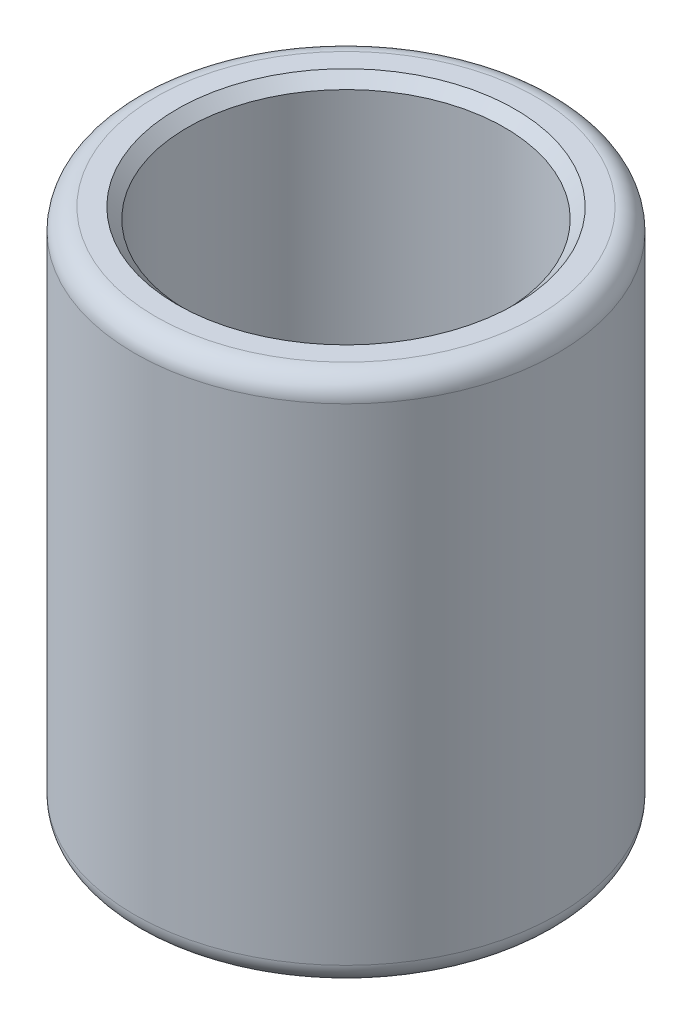
ISO-10303-21;
HEADER;
FILE_DESCRIPTION(('STEP AP214'),'2;1');
FILE_NAME('part.step','',(''),(''),'','','');
FILE_SCHEMA(('AUTOMOTIVE_DESIGN { 1 0 10303 214 1 1 1 1 }'));
ENDSEC;
DATA;
#1=APPLICATION_CONTEXT('core data for automotive mechanical design processes');
#2=APPLICATION_PROTOCOL_DEFINITION('international standard','automotive_design',2000,#1);
#3=PRODUCT_CONTEXT('',#1,'mechanical');
#4=PRODUCT('Part','Part','',(#3));
#5=PRODUCT_RELATED_PRODUCT_CATEGORY('part','',(#4));
#6=PRODUCT_DEFINITION_FORMATION('','',#4);
#7=PRODUCT_DEFINITION_CONTEXT('part definition',#1,'design');
#8=PRODUCT_DEFINITION('design','',#6,#7);
#9=PRODUCT_DEFINITION_SHAPE('','',#8);
#10=(LENGTH_UNIT() NAMED_UNIT(*) SI_UNIT(.MILLI.,.METRE.));
#11=(NAMED_UNIT(*) PLANE_ANGLE_UNIT() SI_UNIT($,.RADIAN.));
#12=(NAMED_UNIT(*) SI_UNIT($,.STERADIAN.) SOLID_ANGLE_UNIT());
#13=UNCERTAINTY_MEASURE_WITH_UNIT(LENGTH_MEASURE(1.E-05),#10,'distance_accuracy_value','');
#14=(GEOMETRIC_REPRESENTATION_CONTEXT(3) GLOBAL_UNCERTAINTY_ASSIGNED_CONTEXT((#13)) GLOBAL_UNIT_ASSIGNED_CONTEXT((#10,
#11,#12)) REPRESENTATION_CONTEXT('',''));
#15=CARTESIAN_POINT('',(0.,0.,0.));
#16=DIRECTION('',(0.,0.,1.));
#17=DIRECTION('',(1.,0.,0.));
#18=AXIS2_PLACEMENT_3D('',#15,#16,#17);
#19=CARTESIAN_POINT('',(0.,50.,0.));
#20=DIRECTION('',(0.,1.,0.));
#21=DIRECTION('',(0.,0.,1.));
#22=AXIS2_PLACEMENT_3D('',#19,#20,#21);
#23=PLANE('',#22);
#24=CARTESIAN_POINT('',(0.,50.,0.));
#25=DIRECTION('',(0.,1.,0.));
#26=DIRECTION('',(0.,0.,1.));
#27=AXIS2_PLACEMENT_3D('',#24,#25,#26);
#28=CIRCLE('',#27,16.);
#29=CARTESIAN_POINT('',(0.,50.,16.));
#30=VERTEX_POINT('',#29);
#31=EDGE_CURVE('E10',#30,#30,#28,.F.);
#32=ORIENTED_EDGE('',*,*,#31,.T.);
#33=EDGE_LOOP('',(#32));
#34=FACE_BOUND('',#33,.T.);
#35=CARTESIAN_POINT('',(0.,50.,0.));
#36=DIRECTION('',(0.,1.,0.));
#37=DIRECTION('',(0.,0.,1.));
#38=AXIS2_PLACEMENT_3D('',#35,#36,#37);
#39=CIRCLE('',#38,18.);
#40=CARTESIAN_POINT('',(0.,50.,18.));
#41=VERTEX_POINT('',#40);
#42=EDGE_CURVE('E50',#41,#41,#39,.T.);
#43=ORIENTED_EDGE('',*,*,#42,.T.);
#44=EDGE_LOOP('',(#43));
#45=FACE_BOUND('',#44,.T.);
#46=ADVANCED_FACE('F30',(#34,#45),#23,.T.);
#47=CARTESIAN_POINT('',(0.,0.,0.));
#48=DIRECTION('',(0.,1.,0.));
#49=DIRECTION('',(0.,0.,1.));
#50=AXIS2_PLACEMENT_3D('',#47,#48,#49);
#51=PLANE('',#50);
#52=CARTESIAN_POINT('',(0.,0.,0.));
#53=DIRECTION('',(0.,1.,0.));
#54=DIRECTION('',(0.,0.,1.));
#55=AXIS2_PLACEMENT_3D('',#52,#53,#54);
#56=CIRCLE('',#55,16.);
#57=CARTESIAN_POINT('',(0.,0.,16.));
#58=VERTEX_POINT('',#57);
#59=EDGE_CURVE('E45',#58,#58,#56,.T.);
#60=ORIENTED_EDGE('',*,*,#59,.T.);
#61=EDGE_LOOP('',(#60));
#62=FACE_BOUND('',#61,.T.);
#63=CARTESIAN_POINT('',(0.,0.,0.));
#64=DIRECTION('',(0.,1.,0.));
#65=DIRECTION('',(0.,0.,1.));
#66=AXIS2_PLACEMENT_3D('',#63,#64,#65);
#67=CIRCLE('',#66,18.);
#68=CARTESIAN_POINT('',(0.,0.,18.));
#69=VERTEX_POINT('',#68);
#70=EDGE_CURVE('E53',#69,#69,#67,.F.);
#71=ORIENTED_EDGE('',*,*,#70,.T.);
#72=EDGE_LOOP('',(#71));
#73=FACE_BOUND('',#72,.T.);
#74=ADVANCED_FACE('F74',(#62,#73),#51,.F.);
#75=CARTESIAN_POINT('',(0.,50.,0.));
#76=DIRECTION('',(0.,-1.,0.));
#77=DIRECTION('',(0.,0.,-1.));
#78=AXIS2_PLACEMENT_3D('',#75,#76,#77);
#79=CYLINDRICAL_SURFACE('',#78,20.);
#80=CARTESIAN_POINT('',(0.,2.,0.));
#81=DIRECTION('',(0.,1.,0.));
#82=DIRECTION('',(0.,0.,1.));
#83=AXIS2_PLACEMENT_3D('',#80,#81,#82);
#84=CIRCLE('',#83,20.);
#85=CARTESIAN_POINT('',(0.,2.,20.));
#86=VERTEX_POINT('',#85);
#87=EDGE_CURVE('E56',#86,#86,#84,.T.);
#88=ORIENTED_EDGE('',*,*,#87,.T.);
#89=EDGE_LOOP('',(#88));
#90=FACE_BOUND('',#89,.T.);
#91=CARTESIAN_POINT('',(0.,48.,0.));
#92=DIRECTION('',(0.,1.,0.));
#93=DIRECTION('',(0.,0.,1.));
#94=AXIS2_PLACEMENT_3D('',#91,#92,#93);
#95=CIRCLE('',#94,20.);
#96=CARTESIAN_POINT('',(0.,48.,20.));
#97=VERTEX_POINT('',#96);
#98=EDGE_CURVE('E59',#97,#97,#95,.F.);
#99=ORIENTED_EDGE('',*,*,#98,.T.);
#100=EDGE_LOOP('',(#99));
#101=FACE_BOUND('',#100,.T.);
#102=ADVANCED_FACE('F63',(#90,#101),#79,.T.);
#103=CARTESIAN_POINT('',(0.,50.,0.));
#104=DIRECTION('',(0.,-1.,0.));
#105=DIRECTION('',(0.,0.,-1.));
#106=AXIS2_PLACEMENT_3D('',#103,#104,#105);
#107=CYLINDRICAL_SURFACE('',#106,15.);
#108=CARTESIAN_POINT('',(0.,1.,0.));
#109=DIRECTION('',(0.,1.,0.));
#110=DIRECTION('',(0.,0.,1.));
#111=AXIS2_PLACEMENT_3D('',#108,#109,#110);
#112=CIRCLE('',#111,15.);
#113=CARTESIAN_POINT('',(0.,1.,15.));
#114=VERTEX_POINT('',#113);
#115=EDGE_CURVE('E37',#114,#114,#112,.F.);
#116=ORIENTED_EDGE('',*,*,#115,.T.);
#117=EDGE_LOOP('',(#116));
#118=FACE_BOUND('',#117,.T.);
#119=CARTESIAN_POINT('',(0.,49.,0.));
#120=DIRECTION('',(0.,1.,0.));
#121=DIRECTION('',(0.,0.,1.));
#122=AXIS2_PLACEMENT_3D('',#119,#120,#121);
#123=CIRCLE('',#122,15.);
#124=CARTESIAN_POINT('',(0.,49.,15.));
#125=VERTEX_POINT('',#124);
#126=EDGE_CURVE('E41',#125,#125,#123,.T.);
#127=ORIENTED_EDGE('',*,*,#126,.T.);
#128=EDGE_LOOP('',(#127));
#129=FACE_BOUND('',#128,.T.);
#130=ADVANCED_FACE('F82',(#118,#129),#107,.F.);
#131=CARTESIAN_POINT('',(0.,2.,0.));
#132=DIRECTION('',(0.,1.,0.));
#133=DIRECTION('',(0.,0.,1.));
#134=AXIS2_PLACEMENT_3D('',#131,#132,#133);
#135=TOROIDAL_SURFACE('',#134,18.,2.);
#136=ORIENTED_EDGE('',*,*,#70,.F.);
#137=EDGE_LOOP('',(#136));
#138=FACE_BOUND('',#137,.T.);
#139=ORIENTED_EDGE('',*,*,#87,.F.);
#140=EDGE_LOOP('',(#139));
#141=FACE_BOUND('',#140,.T.);
#142=ADVANCED_FACE('F69',(#138,#141),#135,.T.);
#143=CARTESIAN_POINT('',(0.,48.,0.));
#144=DIRECTION('',(0.,1.,0.));
#145=DIRECTION('',(0.,0.,1.));
#146=AXIS2_PLACEMENT_3D('',#143,#144,#145);
#147=TOROIDAL_SURFACE('',#146,18.,2.);
#148=ORIENTED_EDGE('',*,*,#98,.F.);
#149=EDGE_LOOP('',(#148));
#150=FACE_BOUND('',#149,.T.);
#151=ORIENTED_EDGE('',*,*,#42,.F.);
#152=EDGE_LOOP('',(#151));
#153=FACE_BOUND('',#152,.T.);
#154=ADVANCED_FACE('F65',(#150,#153),#147,.T.);
#155=CARTESIAN_POINT('',(0.,0.,0.));
#156=DIRECTION('',(0.,-1.,0.));
#157=DIRECTION('',(0.,0.,-1.));
#158=AXIS2_PLACEMENT_3D('',#155,#156,#157);
#159=CONICAL_SURFACE('',#158,16.,0.785398163397448);
#160=ORIENTED_EDGE('',*,*,#115,.F.);
#161=EDGE_LOOP('',(#160));
#162=FACE_BOUND('',#161,.T.);
#163=ORIENTED_EDGE('',*,*,#59,.F.);
#164=EDGE_LOOP('',(#163));
#165=FACE_BOUND('',#164,.T.);
#166=ADVANCED_FACE('F68',(#162,#165),#159,.F.);
#167=CARTESIAN_POINT('',(0.,49.,0.));
#168=DIRECTION('',(0.,1.,0.));
#169=DIRECTION('',(0.,0.,1.));
#170=AXIS2_PLACEMENT_3D('',#167,#168,#169);
#171=CONICAL_SURFACE('',#170,15.,0.785398163397455);
#172=ORIENTED_EDGE('',*,*,#31,.F.);
#173=EDGE_LOOP('',(#172));
#174=FACE_BOUND('',#173,.T.);
#175=ORIENTED_EDGE('',*,*,#126,.F.);
#176=EDGE_LOOP('',(#175));
#177=FACE_BOUND('',#176,.T.);
#178=ADVANCED_FACE('F32',(#174,#177),#171,.F.);
#179=CLOSED_SHELL('',(#46,#74,#102,#130,#142,#154,#166,#178));
#180=MANIFOLD_SOLID_BREP('B2',#179);
#181=ADVANCED_BREP_SHAPE_REPRESENTATION('',(#18,#180),#14);
#182=SHAPE_DEFINITION_REPRESENTATION(#9,#181);
ENDSEC;
END-ISO-10303-21;
